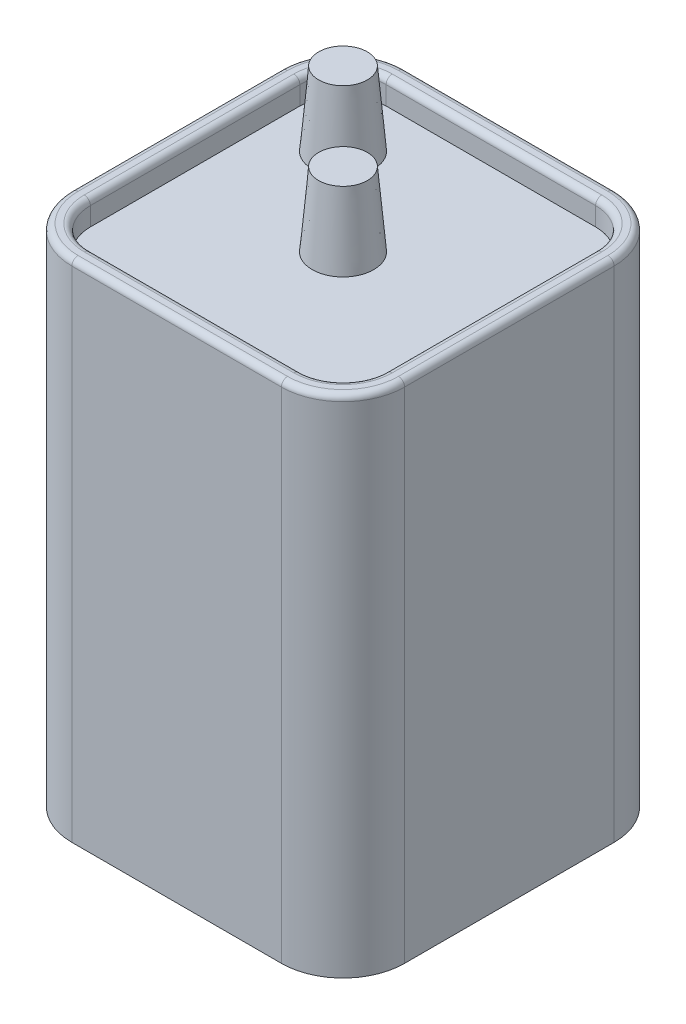
ISO-10303-21;
HEADER;
FILE_DESCRIPTION(('STEP AP214'),'2;1');
FILE_NAME('part.step','',(''),(''),'','','');
FILE_SCHEMA(('AUTOMOTIVE_DESIGN { 1 0 10303 214 1 1 1 1 }'));
ENDSEC;
DATA;
#1=APPLICATION_CONTEXT('core data for automotive mechanical design processes');
#2=APPLICATION_PROTOCOL_DEFINITION('international standard','automotive_design',2000,#1);
#3=PRODUCT_CONTEXT('',#1,'mechanical');
#4=PRODUCT('Part','Part','',(#3));
#5=PRODUCT_RELATED_PRODUCT_CATEGORY('part','',(#4));
#6=PRODUCT_DEFINITION_FORMATION('','',#4);
#7=PRODUCT_DEFINITION_CONTEXT('part definition',#1,'design');
#8=PRODUCT_DEFINITION('design','',#6,#7);
#9=PRODUCT_DEFINITION_SHAPE('','',#8);
#10=(LENGTH_UNIT() NAMED_UNIT(*) SI_UNIT(.MILLI.,.METRE.));
#11=(NAMED_UNIT(*) PLANE_ANGLE_UNIT() SI_UNIT($,.RADIAN.));
#12=(NAMED_UNIT(*) SI_UNIT($,.STERADIAN.) SOLID_ANGLE_UNIT());
#13=UNCERTAINTY_MEASURE_WITH_UNIT(LENGTH_MEASURE(1.E-05),#10,'distance_accuracy_value','');
#14=(GEOMETRIC_REPRESENTATION_CONTEXT(3) GLOBAL_UNCERTAINTY_ASSIGNED_CONTEXT((#13)) GLOBAL_UNIT_ASSIGNED_CONTEXT((#10,
#11,#12)) REPRESENTATION_CONTEXT('',''));
#15=CARTESIAN_POINT('',(0.,0.,0.));
#16=DIRECTION('',(0.,0.,1.));
#17=DIRECTION('',(1.,0.,0.));
#18=AXIS2_PLACEMENT_3D('',#15,#16,#17);
#19=CARTESIAN_POINT('',(34.29,104.14,-34.29));
#20=DIRECTION('',(-1.,0.,0.));
#21=DIRECTION('',(0.,0.,1.));
#22=AXIS2_PLACEMENT_3D('',#19,#20,#21);
#23=PLANE('',#22);
#24=DIRECTION('',(0.,-1.,0.));
#25=VECTOR('',#24,1.);
#26=CARTESIAN_POINT('',(34.29,104.14,-21.59));
#27=LINE('',#26,#25);
#28=CARTESIAN_POINT('',(34.29,0.,-21.59));
#29=VERTEX_POINT('',#28);
#30=CARTESIAN_POINT('',(34.29,102.87,-21.59));
#31=VERTEX_POINT('',#30);
#32=EDGE_CURVE('E303',#29,#31,#27,.F.);
#33=ORIENTED_EDGE('',*,*,#32,.T.);
#34=DIRECTION('',(0.,0.,-1.));
#35=VECTOR('',#34,1.);
#36=CARTESIAN_POINT('',(34.29,102.87,21.59));
#37=LINE('',#36,#35);
#38=CARTESIAN_POINT('',(34.29,102.87,21.59));
#39=VERTEX_POINT('',#38);
#40=EDGE_CURVE('E347',#31,#39,#37,.F.);
#41=ORIENTED_EDGE('',*,*,#40,.T.);
#42=DIRECTION('',(0.,-1.,0.));
#43=VECTOR('',#42,1.);
#44=CARTESIAN_POINT('',(34.29,104.14,21.59));
#45=LINE('',#44,#43);
#46=CARTESIAN_POINT('',(34.29,0.,21.59));
#47=VERTEX_POINT('',#46);
#48=EDGE_CURVE('E301',#39,#47,#45,.T.);
#49=ORIENTED_EDGE('',*,*,#48,.T.);
#50=DIRECTION('',(0.,0.,-1.));
#51=VECTOR('',#50,1.);
#52=CARTESIAN_POINT('',(34.29,0.,-34.29));
#53=LINE('',#52,#51);
#54=EDGE_CURVE('E252',#47,#29,#53,.T.);
#55=ORIENTED_EDGE('',*,*,#54,.T.);
#56=EDGE_LOOP('',(#33,#41,#49,#55));
#57=FACE_BOUND('',#56,.T.);
#58=ADVANCED_FACE('F41',(#57),#23,.F.);
#59=CARTESIAN_POINT('',(-34.29,104.14,-34.29));
#60=DIRECTION('',(0.,0.,1.));
#61=DIRECTION('',(1.,0.,0.));
#62=AXIS2_PLACEMENT_3D('',#59,#60,#61);
#63=PLANE('',#62);
#64=DIRECTION('',(0.,-1.,0.));
#65=VECTOR('',#64,1.);
#66=CARTESIAN_POINT('',(-21.59,104.14,-34.29));
#67=LINE('',#66,#65);
#68=CARTESIAN_POINT('',(-21.59,0.,-34.29));
#69=VERTEX_POINT('',#68);
#70=CARTESIAN_POINT('',(-21.59,102.87,-34.29));
#71=VERTEX_POINT('',#70);
#72=EDGE_CURVE('E298',#69,#71,#67,.F.);
#73=ORIENTED_EDGE('',*,*,#72,.T.);
#74=DIRECTION('',(-1.,0.,0.));
#75=VECTOR('',#74,1.);
#76=CARTESIAN_POINT('',(21.59,102.87,-34.29));
#77=LINE('',#76,#75);
#78=CARTESIAN_POINT('',(21.59,102.87,-34.29));
#79=VERTEX_POINT('',#78);
#80=EDGE_CURVE('E343',#71,#79,#77,.F.);
#81=ORIENTED_EDGE('',*,*,#80,.T.);
#82=DIRECTION('',(0.,-1.,0.));
#83=VECTOR('',#82,1.);
#84=CARTESIAN_POINT('',(21.59,104.14,-34.29));
#85=LINE('',#84,#83);
#86=CARTESIAN_POINT('',(21.59,0.,-34.29));
#87=VERTEX_POINT('',#86);
#88=EDGE_CURVE('E296',#79,#87,#85,.T.);
#89=ORIENTED_EDGE('',*,*,#88,.T.);
#90=DIRECTION('',(-1.,0.,0.));
#91=VECTOR('',#90,1.);
#92=CARTESIAN_POINT('',(-34.29,0.,-34.29));
#93=LINE('',#92,#91);
#94=EDGE_CURVE('E269',#87,#69,#93,.T.);
#95=ORIENTED_EDGE('',*,*,#94,.T.);
#96=EDGE_LOOP('',(#73,#81,#89,#95));
#97=FACE_BOUND('',#96,.T.);
#98=ADVANCED_FACE('F458',(#97),#63,.F.);
#99=CARTESIAN_POINT('',(-34.29,104.14,-34.29));
#100=DIRECTION('',(1.,0.,0.));
#101=DIRECTION('',(0.,0.,-1.));
#102=AXIS2_PLACEMENT_3D('',#99,#100,#101);
#103=PLANE('',#102);
#104=DIRECTION('',(0.,-1.,0.));
#105=VECTOR('',#104,1.);
#106=CARTESIAN_POINT('',(-34.29,104.14,21.59));
#107=LINE('',#106,#105);
#108=CARTESIAN_POINT('',(-34.29,0.,21.59));
#109=VERTEX_POINT('',#108);
#110=CARTESIAN_POINT('',(-34.29,102.87,21.59));
#111=VERTEX_POINT('',#110);
#112=EDGE_CURVE('E293',#109,#111,#107,.F.);
#113=ORIENTED_EDGE('',*,*,#112,.T.);
#114=DIRECTION('',(0.,0.,1.));
#115=VECTOR('',#114,1.);
#116=CARTESIAN_POINT('',(-34.29,102.87,-21.59));
#117=LINE('',#116,#115);
#118=CARTESIAN_POINT('',(-34.29,102.87,-21.59));
#119=VERTEX_POINT('',#118);
#120=EDGE_CURVE('E355',#111,#119,#117,.F.);
#121=ORIENTED_EDGE('',*,*,#120,.T.);
#122=DIRECTION('',(0.,-1.,0.));
#123=VECTOR('',#122,1.);
#124=CARTESIAN_POINT('',(-34.29,104.14,-21.59));
#125=LINE('',#124,#123);
#126=CARTESIAN_POINT('',(-34.29,0.,-21.59));
#127=VERTEX_POINT('',#126);
#128=EDGE_CURVE('E291',#119,#127,#125,.T.);
#129=ORIENTED_EDGE('',*,*,#128,.T.);
#130=DIRECTION('',(0.,0.,1.));
#131=VECTOR('',#130,1.);
#132=CARTESIAN_POINT('',(-34.29,0.,-34.29));
#133=LINE('',#132,#131);
#134=EDGE_CURVE('E272',#127,#109,#133,.T.);
#135=ORIENTED_EDGE('',*,*,#134,.T.);
#136=EDGE_LOOP('',(#113,#121,#129,#135));
#137=FACE_BOUND('',#136,.T.);
#138=ADVANCED_FACE('F465',(#137),#103,.F.);
#139=CARTESIAN_POINT('',(-34.29,104.14,34.29));
#140=DIRECTION('',(0.,0.,-1.));
#141=DIRECTION('',(-1.,0.,0.));
#142=AXIS2_PLACEMENT_3D('',#139,#140,#141);
#143=PLANE('',#142);
#144=DIRECTION('',(0.,-1.,0.));
#145=VECTOR('',#144,1.);
#146=CARTESIAN_POINT('',(21.59,104.14,34.29));
#147=LINE('',#146,#145);
#148=CARTESIAN_POINT('',(21.59,0.,34.29));
#149=VERTEX_POINT('',#148);
#150=CARTESIAN_POINT('',(21.59,102.87,34.29));
#151=VERTEX_POINT('',#150);
#152=EDGE_CURVE('E278',#149,#151,#147,.F.);
#153=ORIENTED_EDGE('',*,*,#152,.T.);
#154=DIRECTION('',(1.,0.,0.));
#155=VECTOR('',#154,1.);
#156=CARTESIAN_POINT('',(-21.59,102.87,34.29));
#157=LINE('',#156,#155);
#158=CARTESIAN_POINT('',(-21.59,102.87,34.29));
#159=VERTEX_POINT('',#158);
#160=EDGE_CURVE('E351',#151,#159,#157,.F.);
#161=ORIENTED_EDGE('',*,*,#160,.T.);
#162=DIRECTION('',(0.,-1.,0.));
#163=VECTOR('',#162,1.);
#164=CARTESIAN_POINT('',(-21.59,104.14,34.29));
#165=LINE('',#164,#163);
#166=CARTESIAN_POINT('',(-21.59,0.,34.29));
#167=VERTEX_POINT('',#166);
#168=EDGE_CURVE('E281',#159,#167,#165,.T.);
#169=ORIENTED_EDGE('',*,*,#168,.T.);
#170=DIRECTION('',(1.,0.,0.));
#171=VECTOR('',#170,1.);
#172=CARTESIAN_POINT('',(-34.29,0.,34.29));
#173=LINE('',#172,#171);
#174=EDGE_CURVE('E275',#167,#149,#173,.T.);
#175=ORIENTED_EDGE('',*,*,#174,.T.);
#176=EDGE_LOOP('',(#153,#161,#169,#175));
#177=FACE_BOUND('',#176,.T.);
#178=ADVANCED_FACE('F676',(#177),#143,.F.);
#179=CARTESIAN_POINT('',(0.,104.14,0.));
#180=DIRECTION('',(0.,1.,0.));
#181=DIRECTION('',(0.,0.,1.));
#182=AXIS2_PLACEMENT_3D('',#179,#180,#181);
#183=PLANE('',#182);
#184=DIRECTION('',(-1.,0.,0.));
#185=VECTOR('',#184,1.);
#186=CARTESIAN_POINT('',(-21.59,104.14,-33.02));
#187=LINE('',#186,#185);
#188=CARTESIAN_POINT('',(21.59,104.14,-33.02));
#189=VERTEX_POINT('',#188);
#190=CARTESIAN_POINT('',(-21.59,104.14,-33.02));
#191=VERTEX_POINT('',#190);
#192=EDGE_CURVE('E335',#189,#191,#187,.T.);
#193=ORIENTED_EDGE('',*,*,#192,.T.);
#194=CARTESIAN_POINT('',(-21.59,104.14,-21.59));
#195=DIRECTION('',(0.,1.,0.));
#196=DIRECTION('',(0.,0.,1.));
#197=AXIS2_PLACEMENT_3D('',#194,#195,#196);
#198=CIRCLE('',#197,11.43);
#199=CARTESIAN_POINT('',(-33.02,104.14,-21.59));
#200=VERTEX_POINT('',#199);
#201=EDGE_CURVE('E337',#191,#200,#198,.T.);
#202=ORIENTED_EDGE('',*,*,#201,.T.);
#203=DIRECTION('',(0.,0.,1.));
#204=VECTOR('',#203,1.);
#205=CARTESIAN_POINT('',(-33.02,104.14,21.59));
#206=LINE('',#205,#204);
#207=CARTESIAN_POINT('',(-33.02,104.14,21.59));
#208=VERTEX_POINT('',#207);
#209=EDGE_CURVE('E323',#200,#208,#206,.T.);
#210=ORIENTED_EDGE('',*,*,#209,.T.);
#211=CARTESIAN_POINT('',(-21.59,104.14,21.59));
#212=DIRECTION('',(0.,1.,0.));
#213=DIRECTION('',(0.,0.,1.));
#214=AXIS2_PLACEMENT_3D('',#211,#212,#213);
#215=CIRCLE('',#214,11.43);
#216=CARTESIAN_POINT('',(-21.59,104.14,33.02));
#217=VERTEX_POINT('',#216);
#218=EDGE_CURVE('E325',#208,#217,#215,.T.);
#219=ORIENTED_EDGE('',*,*,#218,.T.);
#220=DIRECTION('',(1.,0.,0.));
#221=VECTOR('',#220,1.);
#222=CARTESIAN_POINT('',(21.59,104.14,33.02));
#223=LINE('',#222,#221);
#224=CARTESIAN_POINT('',(21.59,104.14,33.02));
#225=VERTEX_POINT('',#224);
#226=EDGE_CURVE('E327',#217,#225,#223,.T.);
#227=ORIENTED_EDGE('',*,*,#226,.T.);
#228=CARTESIAN_POINT('',(21.59,104.14,21.59));
#229=DIRECTION('',(0.,1.,0.));
#230=DIRECTION('',(0.,0.,1.));
#231=AXIS2_PLACEMENT_3D('',#228,#229,#230);
#232=CIRCLE('',#231,11.43);
#233=CARTESIAN_POINT('',(33.02,104.14,21.59));
#234=VERTEX_POINT('',#233);
#235=EDGE_CURVE('E329',#225,#234,#232,.T.);
#236=ORIENTED_EDGE('',*,*,#235,.T.);
#237=DIRECTION('',(0.,0.,-1.));
#238=VECTOR('',#237,1.);
#239=CARTESIAN_POINT('',(33.02,104.14,-21.59));
#240=LINE('',#239,#238);
#241=CARTESIAN_POINT('',(33.02,104.14,-21.59));
#242=VERTEX_POINT('',#241);
#243=EDGE_CURVE('E331',#234,#242,#240,.T.);
#244=ORIENTED_EDGE('',*,*,#243,.T.);
#245=CARTESIAN_POINT('',(21.59,104.14,-21.59));
#246=DIRECTION('',(0.,1.,0.));
#247=DIRECTION('',(0.,0.,1.));
#248=AXIS2_PLACEMENT_3D('',#245,#246,#247);
#249=CIRCLE('',#248,11.43);
#250=EDGE_CURVE('E333',#242,#189,#249,.T.);
#251=ORIENTED_EDGE('',*,*,#250,.T.);
#252=EDGE_LOOP('',(#193,#202,#210,#219,#227,#236,#244,#251));
#253=FACE_BOUND('',#252,.T.);
#254=CARTESIAN_POINT('',(-21.59,104.14,21.59));
#255=DIRECTION('',(0.,1.,0.));
#256=DIRECTION('',(0.,0.,1.));
#257=AXIS2_PLACEMENT_3D('',#254,#255,#256);
#258=CIRCLE('',#257,10.16);
#259=CARTESIAN_POINT('',(-21.59,104.14,31.75));
#260=VERTEX_POINT('',#259);
#261=CARTESIAN_POINT('',(-31.75,104.14,21.59));
#262=VERTEX_POINT('',#261);
#263=EDGE_CURVE('E318',#260,#262,#258,.F.);
#264=ORIENTED_EDGE('',*,*,#263,.T.);
#265=DIRECTION('',(0.,0.,1.));
#266=VECTOR('',#265,1.);
#267=CARTESIAN_POINT('',(-31.75,104.14,-21.59));
#268=LINE('',#267,#266);
#269=CARTESIAN_POINT('',(-31.75,104.14,-21.59));
#270=VERTEX_POINT('',#269);
#271=EDGE_CURVE('E320',#262,#270,#268,.F.);
#272=ORIENTED_EDGE('',*,*,#271,.T.);
#273=CARTESIAN_POINT('',(-21.59,104.14,-21.59));
#274=DIRECTION('',(0.,1.,0.));
#275=DIRECTION('',(0.,0.,1.));
#276=AXIS2_PLACEMENT_3D('',#273,#274,#275);
#277=CIRCLE('',#276,10.16);
#278=CARTESIAN_POINT('',(-21.59,104.14,-31.75));
#279=VERTEX_POINT('',#278);
#280=EDGE_CURVE('E306',#270,#279,#277,.F.);
#281=ORIENTED_EDGE('',*,*,#280,.T.);
#282=DIRECTION('',(-1.,0.,0.));
#283=VECTOR('',#282,1.);
#284=CARTESIAN_POINT('',(21.59,104.14,-31.75));
#285=LINE('',#284,#283);
#286=CARTESIAN_POINT('',(21.59,104.14,-31.75));
#287=VERTEX_POINT('',#286);
#288=EDGE_CURVE('E308',#279,#287,#285,.F.);
#289=ORIENTED_EDGE('',*,*,#288,.T.);
#290=CARTESIAN_POINT('',(21.59,104.14,-21.59));
#291=DIRECTION('',(0.,1.,0.));
#292=DIRECTION('',(0.,0.,1.));
#293=AXIS2_PLACEMENT_3D('',#290,#291,#292);
#294=CIRCLE('',#293,10.16);
#295=CARTESIAN_POINT('',(31.75,104.14,-21.59));
#296=VERTEX_POINT('',#295);
#297=EDGE_CURVE('E310',#287,#296,#294,.F.);
#298=ORIENTED_EDGE('',*,*,#297,.T.);
#299=DIRECTION('',(0.,0.,-1.));
#300=VECTOR('',#299,1.);
#301=CARTESIAN_POINT('',(31.75,104.14,21.59));
#302=LINE('',#301,#300);
#303=CARTESIAN_POINT('',(31.75,104.14,21.59));
#304=VERTEX_POINT('',#303);
#305=EDGE_CURVE('E312',#296,#304,#302,.F.);
#306=ORIENTED_EDGE('',*,*,#305,.T.);
#307=CARTESIAN_POINT('',(21.59,104.14,21.59));
#308=DIRECTION('',(0.,1.,0.));
#309=DIRECTION('',(0.,0.,1.));
#310=AXIS2_PLACEMENT_3D('',#307,#308,#309);
#311=CIRCLE('',#310,10.16);
#312=CARTESIAN_POINT('',(21.59,104.14,31.75));
#313=VERTEX_POINT('',#312);
#314=EDGE_CURVE('E314',#304,#313,#311,.F.);
#315=ORIENTED_EDGE('',*,*,#314,.T.);
#316=DIRECTION('',(1.,0.,0.));
#317=VECTOR('',#316,1.);
#318=CARTESIAN_POINT('',(-21.59,104.14,31.75));
#319=LINE('',#318,#317);
#320=EDGE_CURVE('E316',#313,#260,#319,.F.);
#321=ORIENTED_EDGE('',*,*,#320,.T.);
#322=EDGE_LOOP('',(#264,#272,#281,#289,#298,#306,#315,#321));
#323=FACE_BOUND('',#322,.T.);
#324=ADVANCED_FACE('F419',(#253,#323),#183,.T.);
#325=CARTESIAN_POINT('',(0.,0.,0.));
#326=DIRECTION('',(0.,1.,0.));
#327=DIRECTION('',(0.,0.,1.));
#328=AXIS2_PLACEMENT_3D('',#325,#326,#327);
#329=PLANE('',#328);
#330=ORIENTED_EDGE('',*,*,#174,.F.);
#331=CARTESIAN_POINT('',(-21.59,0.,21.59));
#332=DIRECTION('',(0.,1.,0.));
#333=DIRECTION('',(0.,0.,1.));
#334=AXIS2_PLACEMENT_3D('',#331,#332,#333);
#335=CIRCLE('',#334,12.7);
#336=EDGE_CURVE('E289',#167,#109,#335,.F.);
#337=ORIENTED_EDGE('',*,*,#336,.T.);
#338=ORIENTED_EDGE('',*,*,#134,.F.);
#339=CARTESIAN_POINT('',(-21.59,0.,-21.59));
#340=DIRECTION('',(0.,1.,0.));
#341=DIRECTION('',(0.,0.,1.));
#342=AXIS2_PLACEMENT_3D('',#339,#340,#341);
#343=CIRCLE('',#342,12.7);
#344=EDGE_CURVE('E287',#127,#69,#343,.F.);
#345=ORIENTED_EDGE('',*,*,#344,.T.);
#346=ORIENTED_EDGE('',*,*,#94,.F.);
#347=CARTESIAN_POINT('',(21.59,0.,-21.59));
#348=DIRECTION('',(0.,1.,0.));
#349=DIRECTION('',(0.,0.,1.));
#350=AXIS2_PLACEMENT_3D('',#347,#348,#349);
#351=CIRCLE('',#350,12.7);
#352=EDGE_CURVE('E285',#87,#29,#351,.F.);
#353=ORIENTED_EDGE('',*,*,#352,.T.);
#354=ORIENTED_EDGE('',*,*,#54,.F.);
#355=CARTESIAN_POINT('',(21.59,0.,21.59));
#356=DIRECTION('',(0.,1.,0.));
#357=DIRECTION('',(0.,0.,1.));
#358=AXIS2_PLACEMENT_3D('',#355,#356,#357);
#359=CIRCLE('',#358,12.7);
#360=EDGE_CURVE('E283',#47,#149,#359,.F.);
#361=ORIENTED_EDGE('',*,*,#360,.T.);
#362=EDGE_LOOP('',(#330,#337,#338,#345,#346,#353,#354,#361));
#363=FACE_BOUND('',#362,.T.);
#364=ADVANCED_FACE('F474',(#363),#329,.F.);
#365=CARTESIAN_POINT('',(-21.59,104.14,21.59));
#366=DIRECTION('',(0.,-1.,0.));
#367=DIRECTION('',(0.,0.,-1.));
#368=AXIS2_PLACEMENT_3D('',#365,#366,#367);
#369=CYLINDRICAL_SURFACE('',#368,12.7);
#370=ORIENTED_EDGE('',*,*,#168,.F.);
#371=CARTESIAN_POINT('',(-21.59,102.87,21.59));
#372=DIRECTION('',(0.,1.,0.));
#373=DIRECTION('',(0.,0.,1.));
#374=AXIS2_PLACEMENT_3D('',#371,#372,#373);
#375=CIRCLE('',#374,12.7);
#376=EDGE_CURVE('E353',#159,#111,#375,.F.);
#377=ORIENTED_EDGE('',*,*,#376,.T.);
#378=ORIENTED_EDGE('',*,*,#112,.F.);
#379=ORIENTED_EDGE('',*,*,#336,.F.);
#380=EDGE_LOOP('',(#370,#377,#378,#379));
#381=FACE_BOUND('',#380,.T.);
#382=ADVANCED_FACE('F470',(#381),#369,.T.);
#383=CARTESIAN_POINT('',(-21.59,104.14,-21.59));
#384=DIRECTION('',(0.,-1.,0.));
#385=DIRECTION('',(0.,0.,-1.));
#386=AXIS2_PLACEMENT_3D('',#383,#384,#385);
#387=CYLINDRICAL_SURFACE('',#386,12.7);
#388=ORIENTED_EDGE('',*,*,#128,.F.);
#389=CARTESIAN_POINT('',(-21.59,102.87,-21.59));
#390=DIRECTION('',(0.,1.,0.));
#391=DIRECTION('',(0.,0.,1.));
#392=AXIS2_PLACEMENT_3D('',#389,#390,#391);
#393=CIRCLE('',#392,12.7);
#394=EDGE_CURVE('E340',#119,#71,#393,.F.);
#395=ORIENTED_EDGE('',*,*,#394,.T.);
#396=ORIENTED_EDGE('',*,*,#72,.F.);
#397=ORIENTED_EDGE('',*,*,#344,.F.);
#398=EDGE_LOOP('',(#388,#395,#396,#397));
#399=FACE_BOUND('',#398,.T.);
#400=ADVANCED_FACE('F473',(#399),#387,.T.);
#401=CARTESIAN_POINT('',(21.59,104.14,-21.59));
#402=DIRECTION('',(0.,-1.,0.));
#403=DIRECTION('',(0.,0.,-1.));
#404=AXIS2_PLACEMENT_3D('',#401,#402,#403);
#405=CYLINDRICAL_SURFACE('',#404,12.7);
#406=ORIENTED_EDGE('',*,*,#88,.F.);
#407=CARTESIAN_POINT('',(21.59,102.87,-21.59));
#408=DIRECTION('',(0.,1.,0.));
#409=DIRECTION('',(0.,0.,1.));
#410=AXIS2_PLACEMENT_3D('',#407,#408,#409);
#411=CIRCLE('',#410,12.7);
#412=EDGE_CURVE('E345',#79,#31,#411,.F.);
#413=ORIENTED_EDGE('',*,*,#412,.T.);
#414=ORIENTED_EDGE('',*,*,#32,.F.);
#415=ORIENTED_EDGE('',*,*,#352,.F.);
#416=EDGE_LOOP('',(#406,#413,#414,#415));
#417=FACE_BOUND('',#416,.T.);
#418=ADVANCED_FACE('F478',(#417),#405,.T.);
#419=CARTESIAN_POINT('',(21.59,104.14,21.59));
#420=DIRECTION('',(0.,-1.,0.));
#421=DIRECTION('',(0.,0.,-1.));
#422=AXIS2_PLACEMENT_3D('',#419,#420,#421);
#423=CYLINDRICAL_SURFACE('',#422,12.7);
#424=ORIENTED_EDGE('',*,*,#48,.F.);
#425=CARTESIAN_POINT('',(21.59,102.87,21.59));
#426=DIRECTION('',(0.,1.,0.));
#427=DIRECTION('',(0.,0.,1.));
#428=AXIS2_PLACEMENT_3D('',#425,#426,#427);
#429=CIRCLE('',#428,12.7);
#430=EDGE_CURVE('E349',#39,#151,#429,.F.);
#431=ORIENTED_EDGE('',*,*,#430,.T.);
#432=ORIENTED_EDGE('',*,*,#152,.F.);
#433=ORIENTED_EDGE('',*,*,#360,.F.);
#434=EDGE_LOOP('',(#424,#431,#432,#433));
#435=FACE_BOUND('',#434,.T.);
#436=ADVANCED_FACE('F482',(#435),#423,.T.);
#437=CARTESIAN_POINT('',(-21.59,99.06,-21.59));
#438=DIRECTION('',(0.,1.,0.));
#439=DIRECTION('',(0.,0.,1.));
#440=AXIS2_PLACEMENT_3D('',#437,#438,#439);
#441=CYLINDRICAL_SURFACE('',#440,8.89);
#442=DIRECTION('',(0.,1.,0.));
#443=VECTOR('',#442,1.);
#444=CARTESIAN_POINT('',(-21.59,99.06,-30.48));
#445=LINE('',#444,#443);
#446=CARTESIAN_POINT('',(-21.59,99.06,-30.48));
#447=VERTEX_POINT('',#446);
#448=CARTESIAN_POINT('',(-21.59,102.87,-30.48));
#449=VERTEX_POINT('',#448);
#450=EDGE_CURVE('E250',#447,#449,#445,.T.);
#451=ORIENTED_EDGE('',*,*,#450,.T.);
#452=CARTESIAN_POINT('',(-21.59,102.87,-21.59));
#453=DIRECTION('',(0.,1.,0.));
#454=DIRECTION('',(0.,0.,1.));
#455=AXIS2_PLACEMENT_3D('',#452,#453,#454);
#456=CIRCLE('',#455,8.89);
#457=CARTESIAN_POINT('',(-30.48,102.87,-21.59));
#458=VERTEX_POINT('',#457);
#459=EDGE_CURVE('E11',#449,#458,#456,.T.);
#460=ORIENTED_EDGE('',*,*,#459,.T.);
#461=DIRECTION('',(0.,1.,0.));
#462=VECTOR('',#461,1.);
#463=CARTESIAN_POINT('',(-30.48,99.06,-21.59));
#464=LINE('',#463,#462);
#465=CARTESIAN_POINT('',(-30.48,99.06,-21.59));
#466=VERTEX_POINT('',#465);
#467=EDGE_CURVE('E203',#466,#458,#464,.T.);
#468=ORIENTED_EDGE('',*,*,#467,.F.);
#469=CARTESIAN_POINT('',(-21.59,99.06,-21.59));
#470=DIRECTION('',(0.,1.,0.));
#471=DIRECTION('',(0.,0.,1.));
#472=AXIS2_PLACEMENT_3D('',#469,#470,#471);
#473=CIRCLE('',#472,8.89);
#474=EDGE_CURVE('E207',#447,#466,#473,.T.);
#475=ORIENTED_EDGE('',*,*,#474,.F.);
#476=EDGE_LOOP('',(#451,#460,#468,#475));
#477=FACE_BOUND('',#476,.T.);
#478=ADVANCED_FACE('F205',(#477),#441,.F.);
#479=CARTESIAN_POINT('',(21.59,99.06,-30.48));
#480=DIRECTION('',(0.,0.,-1.));
#481=DIRECTION('',(-1.,0.,0.));
#482=AXIS2_PLACEMENT_3D('',#479,#480,#481);
#483=PLANE('',#482);
#484=DIRECTION('',(0.,1.,0.));
#485=VECTOR('',#484,1.);
#486=CARTESIAN_POINT('',(21.59,99.06,-30.48));
#487=LINE('',#486,#485);
#488=CARTESIAN_POINT('',(21.59,99.06,-30.48));
#489=VERTEX_POINT('',#488);
#490=CARTESIAN_POINT('',(21.59,102.87,-30.48));
#491=VERTEX_POINT('',#490);
#492=EDGE_CURVE('E253',#489,#491,#487,.T.);
#493=ORIENTED_EDGE('',*,*,#492,.T.);
#494=DIRECTION('',(-1.,0.,0.));
#495=VECTOR('',#494,1.);
#496=CARTESIAN_POINT('',(-21.59,102.87,-30.48));
#497=LINE('',#496,#495);
#498=EDGE_CURVE('E50',#491,#449,#497,.T.);
#499=ORIENTED_EDGE('',*,*,#498,.T.);
#500=ORIENTED_EDGE('',*,*,#450,.F.);
#501=DIRECTION('',(-1.,0.,0.));
#502=VECTOR('',#501,1.);
#503=CARTESIAN_POINT('',(21.59,99.06,-30.48));
#504=LINE('',#503,#502);
#505=EDGE_CURVE('E214',#489,#447,#504,.T.);
#506=ORIENTED_EDGE('',*,*,#505,.F.);
#507=EDGE_LOOP('',(#493,#499,#500,#506));
#508=FACE_BOUND('',#507,.T.);
#509=ADVANCED_FACE('F447',(#508),#483,.F.);
#510=CARTESIAN_POINT('',(21.59,99.06,-21.59));
#511=DIRECTION('',(0.,1.,0.));
#512=DIRECTION('',(0.,0.,1.));
#513=AXIS2_PLACEMENT_3D('',#510,#511,#512);
#514=CYLINDRICAL_SURFACE('',#513,8.89);
#515=DIRECTION('',(0.,1.,0.));
#516=VECTOR('',#515,1.);
#517=CARTESIAN_POINT('',(30.48,99.06,-21.59));
#518=LINE('',#517,#516);
#519=CARTESIAN_POINT('',(30.48,99.06,-21.59));
#520=VERTEX_POINT('',#519);
#521=CARTESIAN_POINT('',(30.48,102.87,-21.59));
#522=VERTEX_POINT('',#521);
#523=EDGE_CURVE('E255',#520,#522,#518,.T.);
#524=ORIENTED_EDGE('',*,*,#523,.T.);
#525=CARTESIAN_POINT('',(21.59,102.87,-21.59));
#526=DIRECTION('',(0.,1.,0.));
#527=DIRECTION('',(0.,0.,1.));
#528=AXIS2_PLACEMENT_3D('',#525,#526,#527);
#529=CIRCLE('',#528,8.89);
#530=EDGE_CURVE('E65',#522,#491,#529,.T.);
#531=ORIENTED_EDGE('',*,*,#530,.T.);
#532=ORIENTED_EDGE('',*,*,#492,.F.);
#533=CARTESIAN_POINT('',(21.59,99.06,-21.59));
#534=DIRECTION('',(0.,1.,0.));
#535=DIRECTION('',(0.,0.,1.));
#536=AXIS2_PLACEMENT_3D('',#533,#534,#535);
#537=CIRCLE('',#536,8.89);
#538=EDGE_CURVE('E247',#520,#489,#537,.T.);
#539=ORIENTED_EDGE('',*,*,#538,.F.);
#540=EDGE_LOOP('',(#524,#531,#532,#539));
#541=FACE_BOUND('',#540,.T.);
#542=ADVANCED_FACE('F448',(#541),#514,.F.);
#543=CARTESIAN_POINT('',(30.48,99.06,21.59));
#544=DIRECTION('',(1.,0.,0.));
#545=DIRECTION('',(0.,0.,-1.));
#546=AXIS2_PLACEMENT_3D('',#543,#544,#545);
#547=PLANE('',#546);
#548=DIRECTION('',(0.,1.,0.));
#549=VECTOR('',#548,1.);
#550=CARTESIAN_POINT('',(30.48,99.06,21.59));
#551=LINE('',#550,#549);
#552=CARTESIAN_POINT('',(30.48,99.06,21.59));
#553=VERTEX_POINT('',#552);
#554=CARTESIAN_POINT('',(30.48,102.87,21.59));
#555=VERTEX_POINT('',#554);
#556=EDGE_CURVE('E257',#553,#555,#551,.T.);
#557=ORIENTED_EDGE('',*,*,#556,.T.);
#558=DIRECTION('',(0.,0.,-1.));
#559=VECTOR('',#558,1.);
#560=CARTESIAN_POINT('',(30.48,102.87,-21.59));
#561=LINE('',#560,#559);
#562=EDGE_CURVE('E365',#555,#522,#561,.T.);
#563=ORIENTED_EDGE('',*,*,#562,.T.);
#564=ORIENTED_EDGE('',*,*,#523,.F.);
#565=DIRECTION('',(0.,0.,-1.));
#566=VECTOR('',#565,1.);
#567=CARTESIAN_POINT('',(30.48,99.06,21.59));
#568=LINE('',#567,#566);
#569=EDGE_CURVE('E244',#553,#520,#568,.T.);
#570=ORIENTED_EDGE('',*,*,#569,.F.);
#571=EDGE_LOOP('',(#557,#563,#564,#570));
#572=FACE_BOUND('',#571,.T.);
#573=ADVANCED_FACE('F445',(#572),#547,.F.);
#574=CARTESIAN_POINT('',(21.59,99.06,21.59));
#575=DIRECTION('',(0.,1.,0.));
#576=DIRECTION('',(0.,0.,1.));
#577=AXIS2_PLACEMENT_3D('',#574,#575,#576);
#578=CYLINDRICAL_SURFACE('',#577,8.89);
#579=DIRECTION('',(0.,1.,0.));
#580=VECTOR('',#579,1.);
#581=CARTESIAN_POINT('',(21.59,99.06,30.48));
#582=LINE('',#581,#580);
#583=CARTESIAN_POINT('',(21.59,99.06,30.48));
#584=VERTEX_POINT('',#583);
#585=CARTESIAN_POINT('',(21.59,102.87,30.48));
#586=VERTEX_POINT('',#585);
#587=EDGE_CURVE('E260',#584,#586,#582,.T.);
#588=ORIENTED_EDGE('',*,*,#587,.T.);
#589=CARTESIAN_POINT('',(21.59,102.87,21.59));
#590=DIRECTION('',(0.,1.,0.));
#591=DIRECTION('',(0.,0.,1.));
#592=AXIS2_PLACEMENT_3D('',#589,#590,#591);
#593=CIRCLE('',#592,8.89);
#594=EDGE_CURVE('E363',#586,#555,#593,.T.);
#595=ORIENTED_EDGE('',*,*,#594,.T.);
#596=ORIENTED_EDGE('',*,*,#556,.F.);
#597=CARTESIAN_POINT('',(21.59,99.06,21.59));
#598=DIRECTION('',(0.,1.,0.));
#599=DIRECTION('',(0.,0.,1.));
#600=AXIS2_PLACEMENT_3D('',#597,#598,#599);
#601=CIRCLE('',#600,8.89);
#602=EDGE_CURVE('E241',#584,#553,#601,.T.);
#603=ORIENTED_EDGE('',*,*,#602,.F.);
#604=EDGE_LOOP('',(#588,#595,#596,#603));
#605=FACE_BOUND('',#604,.T.);
#606=ADVANCED_FACE('F442',(#605),#578,.F.);
#607=CARTESIAN_POINT('',(-21.59,99.06,30.48));
#608=DIRECTION('',(0.,0.,1.));
#609=DIRECTION('',(1.,0.,0.));
#610=AXIS2_PLACEMENT_3D('',#607,#608,#609);
#611=PLANE('',#610);
#612=DIRECTION('',(0.,1.,0.));
#613=VECTOR('',#612,1.);
#614=CARTESIAN_POINT('',(-21.59,99.06,30.48));
#615=LINE('',#614,#613);
#616=CARTESIAN_POINT('',(-21.59,99.06,30.48));
#617=VERTEX_POINT('',#616);
#618=CARTESIAN_POINT('',(-21.59,102.87,30.48));
#619=VERTEX_POINT('',#618);
#620=EDGE_CURVE('E263',#617,#619,#615,.T.);
#621=ORIENTED_EDGE('',*,*,#620,.T.);
#622=DIRECTION('',(1.,0.,0.));
#623=VECTOR('',#622,1.);
#624=CARTESIAN_POINT('',(21.59,102.87,30.48));
#625=LINE('',#624,#623);
#626=EDGE_CURVE('E361',#619,#586,#625,.T.);
#627=ORIENTED_EDGE('',*,*,#626,.T.);
#628=ORIENTED_EDGE('',*,*,#587,.F.);
#629=DIRECTION('',(1.,0.,0.));
#630=VECTOR('',#629,1.);
#631=CARTESIAN_POINT('',(-21.59,99.06,30.48));
#632=LINE('',#631,#630);
#633=EDGE_CURVE('E238',#617,#584,#632,.T.);
#634=ORIENTED_EDGE('',*,*,#633,.F.);
#635=EDGE_LOOP('',(#621,#627,#628,#634));
#636=FACE_BOUND('',#635,.T.);
#637=ADVANCED_FACE('F439',(#636),#611,.F.);
#638=CARTESIAN_POINT('',(-21.59,99.06,21.59));
#639=DIRECTION('',(0.,1.,0.));
#640=DIRECTION('',(0.,0.,1.));
#641=AXIS2_PLACEMENT_3D('',#638,#639,#640);
#642=CYLINDRICAL_SURFACE('',#641,8.89);
#643=DIRECTION('',(0.,1.,0.));
#644=VECTOR('',#643,1.);
#645=CARTESIAN_POINT('',(-30.48,99.06,21.59));
#646=LINE('',#645,#644);
#647=CARTESIAN_POINT('',(-30.48,99.06,21.59));
#648=VERTEX_POINT('',#647);
#649=CARTESIAN_POINT('',(-30.48,102.87,21.59));
#650=VERTEX_POINT('',#649);
#651=EDGE_CURVE('E213',#648,#650,#646,.T.);
#652=ORIENTED_EDGE('',*,*,#651,.T.);
#653=CARTESIAN_POINT('',(-21.59,102.87,21.59));
#654=DIRECTION('',(0.,1.,0.));
#655=DIRECTION('',(0.,0.,1.));
#656=AXIS2_PLACEMENT_3D('',#653,#654,#655);
#657=CIRCLE('',#656,8.89);
#658=EDGE_CURVE('E359',#650,#619,#657,.T.);
#659=ORIENTED_EDGE('',*,*,#658,.T.);
#660=ORIENTED_EDGE('',*,*,#620,.F.);
#661=CARTESIAN_POINT('',(-21.59,99.06,21.59));
#662=DIRECTION('',(0.,1.,0.));
#663=DIRECTION('',(0.,0.,1.));
#664=AXIS2_PLACEMENT_3D('',#661,#662,#663);
#665=CIRCLE('',#664,8.89);
#666=EDGE_CURVE('E223',#648,#617,#665,.T.);
#667=ORIENTED_EDGE('',*,*,#666,.F.);
#668=EDGE_LOOP('',(#652,#659,#660,#667));
#669=FACE_BOUND('',#668,.T.);
#670=ADVANCED_FACE('F435',(#669),#642,.F.);
#671=CARTESIAN_POINT('',(-30.48,99.06,-21.59));
#672=DIRECTION('',(-1.,0.,0.));
#673=DIRECTION('',(0.,0.,1.));
#674=AXIS2_PLACEMENT_3D('',#671,#672,#673);
#675=PLANE('',#674);
#676=ORIENTED_EDGE('',*,*,#467,.T.);
#677=DIRECTION('',(0.,0.,1.));
#678=VECTOR('',#677,1.);
#679=CARTESIAN_POINT('',(-30.48,102.87,21.59));
#680=LINE('',#679,#678);
#681=EDGE_CURVE('E357',#458,#650,#680,.T.);
#682=ORIENTED_EDGE('',*,*,#681,.T.);
#683=ORIENTED_EDGE('',*,*,#651,.F.);
#684=DIRECTION('',(0.,0.,1.));
#685=VECTOR('',#684,1.);
#686=CARTESIAN_POINT('',(-30.48,99.06,-21.59));
#687=LINE('',#686,#685);
#688=EDGE_CURVE('E217',#466,#648,#687,.T.);
#689=ORIENTED_EDGE('',*,*,#688,.F.);
#690=EDGE_LOOP('',(#676,#682,#683,#689));
#691=FACE_BOUND('',#690,.T.);
#692=ADVANCED_FACE('F218',(#691),#675,.F.);
#693=CARTESIAN_POINT('',(-21.59,99.06,-21.59));
#694=DIRECTION('',(0.,1.,0.));
#695=DIRECTION('',(0.,0.,1.));
#696=AXIS2_PLACEMENT_3D('',#693,#694,#695);
#697=PLANE('',#696);
#698=CARTESIAN_POINT('',(0.,99.06,0.));
#699=DIRECTION('',(0.,1.,0.));
#700=DIRECTION('',(0.,0.,1.));
#701=AXIS2_PLACEMENT_3D('',#698,#699,#700);
#702=CIRCLE('',#701,6.35);
#703=CARTESIAN_POINT('',(0.,99.06,6.35));
#704=VERTEX_POINT('',#703);
#705=EDGE_CURVE('E849',#704,#704,#702,.T.);
#706=ORIENTED_EDGE('',*,*,#705,.F.);
#707=EDGE_LOOP('',(#706));
#708=FACE_BOUND('',#707,.T.);
#709=CARTESIAN_POINT('',(-17.9605122421382,99.06,-17.9605122421384));
#710=DIRECTION('',(0.,1.,0.));
#711=DIRECTION('',(0.,0.,1.));
#712=AXIS2_PLACEMENT_3D('',#709,#710,#711);
#713=CIRCLE('',#712,6.35);
#714=CARTESIAN_POINT('',(-17.9605122421382,99.06,-11.6105122421384));
#715=VERTEX_POINT('',#714);
#716=EDGE_CURVE('E234',#715,#715,#713,.T.);
#717=ORIENTED_EDGE('',*,*,#716,.F.);
#718=EDGE_LOOP('',(#717));
#719=FACE_BOUND('',#718,.T.);
#720=ORIENTED_EDGE('',*,*,#474,.T.);
#721=ORIENTED_EDGE('',*,*,#688,.T.);
#722=ORIENTED_EDGE('',*,*,#666,.T.);
#723=ORIENTED_EDGE('',*,*,#633,.T.);
#724=ORIENTED_EDGE('',*,*,#602,.T.);
#725=ORIENTED_EDGE('',*,*,#569,.T.);
#726=ORIENTED_EDGE('',*,*,#538,.T.);
#727=ORIENTED_EDGE('',*,*,#505,.T.);
#728=EDGE_LOOP('',(#720,#721,#722,#723,#724,#725,#726,#727));
#729=FACE_BOUND('',#728,.T.);
#730=ADVANCED_FACE('F225',(#708,#719,#729),#697,.T.);
#731=CARTESIAN_POINT('',(21.59,102.87,21.59));
#732=DIRECTION('',(0.,1.,0.));
#733=DIRECTION('',(0.,0.,1.));
#734=AXIS2_PLACEMENT_3D('',#731,#732,#733);
#735=TOROIDAL_SURFACE('',#734,11.43,1.27);
#736=CARTESIAN_POINT('',(21.59,102.87,33.02));
#737=DIRECTION('',(-1.,0.,0.));
#738=DIRECTION('',(0.,0.,1.));
#739=AXIS2_PLACEMENT_3D('',#736,#737,#738);
#740=CIRCLE('',#739,1.27);
#741=EDGE_CURVE('E231',#151,#225,#740,.T.);
#742=ORIENTED_EDGE('',*,*,#741,.F.);
#743=ORIENTED_EDGE('',*,*,#430,.F.);
#744=CARTESIAN_POINT('',(33.02,102.87,21.59));
#745=DIRECTION('',(0.,0.,-1.));
#746=DIRECTION('',(-1.,0.,0.));
#747=AXIS2_PLACEMENT_3D('',#744,#745,#746);
#748=CIRCLE('',#747,1.27);
#749=EDGE_CURVE('E228',#234,#39,#748,.T.);
#750=ORIENTED_EDGE('',*,*,#749,.F.);
#751=ORIENTED_EDGE('',*,*,#235,.F.);
#752=EDGE_LOOP('',(#742,#743,#750,#751));
#753=FACE_BOUND('',#752,.T.);
#754=ADVANCED_FACE('F514',(#753),#735,.T.);
#755=CARTESIAN_POINT('',(33.02,102.87,0.));
#756=DIRECTION('',(0.,0.,1.));
#757=DIRECTION('',(1.,0.,0.));
#758=AXIS2_PLACEMENT_3D('',#755,#756,#757);
#759=CYLINDRICAL_SURFACE('',#758,1.27);
#760=ORIENTED_EDGE('',*,*,#749,.T.);
#761=ORIENTED_EDGE('',*,*,#40,.F.);
#762=CARTESIAN_POINT('',(33.02,102.87,-21.59));
#763=DIRECTION('',(0.,0.,-1.));
#764=DIRECTION('',(-1.,0.,0.));
#765=AXIS2_PLACEMENT_3D('',#762,#763,#764);
#766=CIRCLE('',#765,1.27);
#767=EDGE_CURVE('E382',#242,#31,#766,.T.);
#768=ORIENTED_EDGE('',*,*,#767,.F.);
#769=ORIENTED_EDGE('',*,*,#243,.F.);
#770=EDGE_LOOP('',(#760,#761,#768,#769));
#771=FACE_BOUND('',#770,.T.);
#772=ADVANCED_FACE('F510',(#771),#759,.T.);
#773=CARTESIAN_POINT('',(0.,102.87,33.02));
#774=DIRECTION('',(-1.,0.,0.));
#775=DIRECTION('',(0.,0.,1.));
#776=AXIS2_PLACEMENT_3D('',#773,#774,#775);
#777=CYLINDRICAL_SURFACE('',#776,1.27);
#778=ORIENTED_EDGE('',*,*,#741,.T.);
#779=ORIENTED_EDGE('',*,*,#226,.F.);
#780=CARTESIAN_POINT('',(-21.59,102.87,33.02));
#781=DIRECTION('',(-1.,0.,0.));
#782=DIRECTION('',(0.,0.,1.));
#783=AXIS2_PLACEMENT_3D('',#780,#781,#782);
#784=CIRCLE('',#783,1.27);
#785=EDGE_CURVE('E379',#159,#217,#784,.T.);
#786=ORIENTED_EDGE('',*,*,#785,.F.);
#787=ORIENTED_EDGE('',*,*,#160,.F.);
#788=EDGE_LOOP('',(#778,#779,#786,#787));
#789=FACE_BOUND('',#788,.T.);
#790=ADVANCED_FACE('F506',(#789),#777,.T.);
#791=CARTESIAN_POINT('',(21.59,102.87,-21.59));
#792=DIRECTION('',(0.,1.,0.));
#793=DIRECTION('',(0.,0.,1.));
#794=AXIS2_PLACEMENT_3D('',#791,#792,#793);
#795=TOROIDAL_SURFACE('',#794,11.43,1.27);
#796=ORIENTED_EDGE('',*,*,#767,.T.);
#797=ORIENTED_EDGE('',*,*,#412,.F.);
#798=CARTESIAN_POINT('',(21.59,102.87,-33.02));
#799=DIRECTION('',(-1.,0.,0.));
#800=DIRECTION('',(0.,0.,1.));
#801=AXIS2_PLACEMENT_3D('',#798,#799,#800);
#802=CIRCLE('',#801,1.27);
#803=EDGE_CURVE('E376',#189,#79,#802,.T.);
#804=ORIENTED_EDGE('',*,*,#803,.F.);
#805=ORIENTED_EDGE('',*,*,#250,.F.);
#806=EDGE_LOOP('',(#796,#797,#804,#805));
#807=FACE_BOUND('',#806,.T.);
#808=ADVANCED_FACE('F502',(#807),#795,.T.);
#809=CARTESIAN_POINT('',(-21.59,102.87,21.59));
#810=DIRECTION('',(0.,1.,0.));
#811=DIRECTION('',(0.,0.,1.));
#812=AXIS2_PLACEMENT_3D('',#809,#810,#811);
#813=TOROIDAL_SURFACE('',#812,11.43,1.27);
#814=ORIENTED_EDGE('',*,*,#785,.T.);
#815=ORIENTED_EDGE('',*,*,#218,.F.);
#816=CARTESIAN_POINT('',(-33.02,102.87,21.59));
#817=DIRECTION('',(0.,0.,-1.));
#818=DIRECTION('',(-1.,0.,0.));
#819=AXIS2_PLACEMENT_3D('',#816,#817,#818);
#820=CIRCLE('',#819,1.27);
#821=EDGE_CURVE('E373',#111,#208,#820,.T.);
#822=ORIENTED_EDGE('',*,*,#821,.F.);
#823=ORIENTED_EDGE('',*,*,#376,.F.);
#824=EDGE_LOOP('',(#814,#815,#822,#823));
#825=FACE_BOUND('',#824,.T.);
#826=ADVANCED_FACE('F498',(#825),#813,.T.);
#827=CARTESIAN_POINT('',(0.,102.87,-33.02));
#828=DIRECTION('',(1.,0.,0.));
#829=DIRECTION('',(0.,0.,-1.));
#830=AXIS2_PLACEMENT_3D('',#827,#828,#829);
#831=CYLINDRICAL_SURFACE('',#830,1.27);
#832=ORIENTED_EDGE('',*,*,#803,.T.);
#833=ORIENTED_EDGE('',*,*,#80,.F.);
#834=CARTESIAN_POINT('',(-21.59,102.87,-33.02));
#835=DIRECTION('',(-1.,0.,0.));
#836=DIRECTION('',(0.,0.,1.));
#837=AXIS2_PLACEMENT_3D('',#834,#835,#836);
#838=CIRCLE('',#837,1.27);
#839=EDGE_CURVE('E371',#191,#71,#838,.T.);
#840=ORIENTED_EDGE('',*,*,#839,.F.);
#841=ORIENTED_EDGE('',*,*,#192,.F.);
#842=EDGE_LOOP('',(#832,#833,#840,#841));
#843=FACE_BOUND('',#842,.T.);
#844=ADVANCED_FACE('F494',(#843),#831,.T.);
#845=CARTESIAN_POINT('',(-33.02,102.87,0.));
#846=DIRECTION('',(0.,0.,-1.));
#847=DIRECTION('',(-1.,0.,0.));
#848=AXIS2_PLACEMENT_3D('',#845,#846,#847);
#849=CYLINDRICAL_SURFACE('',#848,1.27);
#850=ORIENTED_EDGE('',*,*,#821,.T.);
#851=ORIENTED_EDGE('',*,*,#209,.F.);
#852=CARTESIAN_POINT('',(-33.02,102.87,-21.59));
#853=DIRECTION('',(0.,0.,-1.));
#854=DIRECTION('',(-1.,0.,0.));
#855=AXIS2_PLACEMENT_3D('',#852,#853,#854);
#856=CIRCLE('',#855,1.27);
#857=EDGE_CURVE('E369',#119,#200,#856,.T.);
#858=ORIENTED_EDGE('',*,*,#857,.F.);
#859=ORIENTED_EDGE('',*,*,#120,.F.);
#860=EDGE_LOOP('',(#850,#851,#858,#859));
#861=FACE_BOUND('',#860,.T.);
#862=ADVANCED_FACE('F490',(#861),#849,.T.);
#863=CARTESIAN_POINT('',(-21.59,102.87,-21.59));
#864=DIRECTION('',(0.,1.,0.));
#865=DIRECTION('',(0.,0.,1.));
#866=AXIS2_PLACEMENT_3D('',#863,#864,#865);
#867=TOROIDAL_SURFACE('',#866,11.43,1.27);
#868=ORIENTED_EDGE('',*,*,#839,.T.);
#869=ORIENTED_EDGE('',*,*,#394,.F.);
#870=ORIENTED_EDGE('',*,*,#857,.T.);
#871=ORIENTED_EDGE('',*,*,#201,.F.);
#872=EDGE_LOOP('',(#868,#869,#870,#871));
#873=FACE_BOUND('',#872,.T.);
#874=ADVANCED_FACE('F487',(#873),#867,.T.);
#875=CARTESIAN_POINT('',(31.75,102.87,21.59));
#876=DIRECTION('',(0.,0.,1.));
#877=DIRECTION('',(1.,0.,0.));
#878=AXIS2_PLACEMENT_3D('',#875,#876,#877);
#879=CYLINDRICAL_SURFACE('',#878,1.27);
#880=CARTESIAN_POINT('',(31.75,102.87,21.59));
#881=DIRECTION('',(0.,0.,1.));
#882=DIRECTION('',(1.,0.,0.));
#883=AXIS2_PLACEMENT_3D('',#880,#881,#882);
#884=CIRCLE('',#883,1.27);
#885=EDGE_CURVE('E403',#304,#555,#884,.T.);
#886=ORIENTED_EDGE('',*,*,#885,.F.);
#887=ORIENTED_EDGE('',*,*,#305,.F.);
#888=CARTESIAN_POINT('',(31.75,102.87,-21.59));
#889=DIRECTION('',(0.,0.,-1.));
#890=DIRECTION('',(-1.,0.,0.));
#891=AXIS2_PLACEMENT_3D('',#888,#889,#890);
#892=CIRCLE('',#891,1.27);
#893=EDGE_CURVE('E45',#522,#296,#892,.T.);
#894=ORIENTED_EDGE('',*,*,#893,.F.);
#895=ORIENTED_EDGE('',*,*,#562,.F.);
#896=EDGE_LOOP('',(#886,#887,#894,#895));
#897=FACE_BOUND('',#896,.T.);
#898=ADVANCED_FACE('F43',(#897),#879,.T.);
#899=CARTESIAN_POINT('',(21.59,102.87,-21.59));
#900=DIRECTION('',(0.,1.,0.));
#901=DIRECTION('',(0.,0.,1.));
#902=AXIS2_PLACEMENT_3D('',#899,#900,#901);
#903=TOROIDAL_SURFACE('',#902,10.16,1.27);
#904=ORIENTED_EDGE('',*,*,#893,.T.);
#905=ORIENTED_EDGE('',*,*,#297,.F.);
#906=CARTESIAN_POINT('',(21.59,102.87,-31.75));
#907=DIRECTION('',(-1.,0.,0.));
#908=DIRECTION('',(0.,0.,1.));
#909=AXIS2_PLACEMENT_3D('',#906,#907,#908);
#910=CIRCLE('',#909,1.27);
#911=EDGE_CURVE('E401',#491,#287,#910,.T.);
#912=ORIENTED_EDGE('',*,*,#911,.F.);
#913=ORIENTED_EDGE('',*,*,#530,.F.);
#914=EDGE_LOOP('',(#904,#905,#912,#913));
#915=FACE_BOUND('',#914,.T.);
#916=ADVANCED_FACE('F413',(#915),#903,.T.);
#917=CARTESIAN_POINT('',(21.59,102.87,21.59));
#918=DIRECTION('',(0.,1.,0.));
#919=DIRECTION('',(0.,0.,1.));
#920=AXIS2_PLACEMENT_3D('',#917,#918,#919);
#921=TOROIDAL_SURFACE('',#920,10.16,1.27);
#922=ORIENTED_EDGE('',*,*,#885,.T.);
#923=ORIENTED_EDGE('',*,*,#594,.F.);
#924=CARTESIAN_POINT('',(21.59,102.87,31.75));
#925=DIRECTION('',(-1.,0.,0.));
#926=DIRECTION('',(0.,0.,1.));
#927=AXIS2_PLACEMENT_3D('',#924,#925,#926);
#928=CIRCLE('',#927,1.27);
#929=EDGE_CURVE('E398',#313,#586,#928,.T.);
#930=ORIENTED_EDGE('',*,*,#929,.F.);
#931=ORIENTED_EDGE('',*,*,#314,.F.);
#932=EDGE_LOOP('',(#922,#923,#930,#931));
#933=FACE_BOUND('',#932,.T.);
#934=ADVANCED_FACE('F534',(#933),#921,.T.);
#935=CARTESIAN_POINT('',(21.59,102.87,-31.75));
#936=DIRECTION('',(1.,0.,0.));
#937=DIRECTION('',(0.,0.,-1.));
#938=AXIS2_PLACEMENT_3D('',#935,#936,#937);
#939=CYLINDRICAL_SURFACE('',#938,1.27);
#940=ORIENTED_EDGE('',*,*,#911,.T.);
#941=ORIENTED_EDGE('',*,*,#288,.F.);
#942=CARTESIAN_POINT('',(-21.59,102.87,-31.75));
#943=DIRECTION('',(-1.,0.,0.));
#944=DIRECTION('',(0.,0.,1.));
#945=AXIS2_PLACEMENT_3D('',#942,#943,#944);
#946=CIRCLE('',#945,1.27);
#947=EDGE_CURVE('E395',#449,#279,#946,.T.);
#948=ORIENTED_EDGE('',*,*,#947,.F.);
#949=ORIENTED_EDGE('',*,*,#498,.F.);
#950=EDGE_LOOP('',(#940,#941,#948,#949));
#951=FACE_BOUND('',#950,.T.);
#952=ADVANCED_FACE('F425',(#951),#939,.T.);
#953=CARTESIAN_POINT('',(-21.59,102.87,31.75));
#954=DIRECTION('',(-1.,0.,0.));
#955=DIRECTION('',(0.,0.,1.));
#956=AXIS2_PLACEMENT_3D('',#953,#954,#955);
#957=CYLINDRICAL_SURFACE('',#956,1.27);
#958=ORIENTED_EDGE('',*,*,#929,.T.);
#959=ORIENTED_EDGE('',*,*,#626,.F.);
#960=CARTESIAN_POINT('',(-21.59,102.87,31.75));
#961=DIRECTION('',(-1.,0.,0.));
#962=DIRECTION('',(0.,0.,1.));
#963=AXIS2_PLACEMENT_3D('',#960,#961,#962);
#964=CIRCLE('',#963,1.27);
#965=EDGE_CURVE('E392',#260,#619,#964,.T.);
#966=ORIENTED_EDGE('',*,*,#965,.F.);
#967=ORIENTED_EDGE('',*,*,#320,.F.);
#968=EDGE_LOOP('',(#958,#959,#966,#967));
#969=FACE_BOUND('',#968,.T.);
#970=ADVANCED_FACE('F528',(#969),#957,.T.);
#971=CARTESIAN_POINT('',(-21.59,102.87,-21.59));
#972=DIRECTION('',(0.,1.,0.));
#973=DIRECTION('',(0.,0.,1.));
#974=AXIS2_PLACEMENT_3D('',#971,#972,#973);
#975=TOROIDAL_SURFACE('',#974,10.16,1.27);
#976=ORIENTED_EDGE('',*,*,#947,.T.);
#977=ORIENTED_EDGE('',*,*,#280,.F.);
#978=CARTESIAN_POINT('',(-31.75,102.87,-21.59));
#979=DIRECTION('',(0.,0.,1.));
#980=DIRECTION('',(1.,0.,0.));
#981=AXIS2_PLACEMENT_3D('',#978,#979,#980);
#982=CIRCLE('',#981,1.27);
#983=EDGE_CURVE('E389',#458,#270,#982,.T.);
#984=ORIENTED_EDGE('',*,*,#983,.F.);
#985=ORIENTED_EDGE('',*,*,#459,.F.);
#986=EDGE_LOOP('',(#976,#977,#984,#985));
#987=FACE_BOUND('',#986,.T.);
#988=ADVANCED_FACE('F427',(#987),#975,.T.);
#989=CARTESIAN_POINT('',(-21.59,102.87,21.59));
#990=DIRECTION('',(0.,1.,0.));
#991=DIRECTION('',(0.,0.,1.));
#992=AXIS2_PLACEMENT_3D('',#989,#990,#991);
#993=TOROIDAL_SURFACE('',#992,10.16,1.27);
#994=ORIENTED_EDGE('',*,*,#965,.T.);
#995=ORIENTED_EDGE('',*,*,#658,.F.);
#996=CARTESIAN_POINT('',(-31.75,102.87,21.59));
#997=DIRECTION('',(0.,0.,-1.));
#998=DIRECTION('',(-1.,0.,0.));
#999=AXIS2_PLACEMENT_3D('',#996,#997,#998);
#1000=CIRCLE('',#999,1.27);
#1001=EDGE_CURVE('E387',#262,#650,#1000,.T.);
#1002=ORIENTED_EDGE('',*,*,#1001,.F.);
#1003=ORIENTED_EDGE('',*,*,#263,.F.);
#1004=EDGE_LOOP('',(#994,#995,#1002,#1003));
#1005=FACE_BOUND('',#1004,.T.);
#1006=ADVANCED_FACE('F522',(#1005),#993,.T.);
#1007=CARTESIAN_POINT('',(-31.75,102.87,-21.59));
#1008=DIRECTION('',(0.,0.,-1.));
#1009=DIRECTION('',(-1.,0.,0.));
#1010=AXIS2_PLACEMENT_3D('',#1007,#1008,#1009);
#1011=CYLINDRICAL_SURFACE('',#1010,1.27);
#1012=ORIENTED_EDGE('',*,*,#983,.T.);
#1013=ORIENTED_EDGE('',*,*,#271,.F.);
#1014=ORIENTED_EDGE('',*,*,#1001,.T.);
#1015=ORIENTED_EDGE('',*,*,#681,.F.);
#1016=EDGE_LOOP('',(#1012,#1013,#1014,#1015));
#1017=FACE_BOUND('',#1016,.T.);
#1018=ADVANCED_FACE('F431',(#1017),#1011,.T.);
#1019=CARTESIAN_POINT('',(-17.9605122421382,99.06,-17.9605122421384));
#1020=DIRECTION('',(0.,-1.,0.));
#1021=DIRECTION('',(0.,0.,1.));
#1022=AXIS2_PLACEMENT_3D('',#1019,#1020,#1021);
#1023=CONICAL_SURFACE('',#1022,6.35,0.0872664625997167);
#1024=CARTESIAN_POINT('',(-17.9605122421382,114.3,-17.9605122421384));
#1025=DIRECTION('',(0.,1.,0.));
#1026=DIRECTION('',(0.,0.,1.));
#1027=AXIS2_PLACEMENT_3D('',#1024,#1025,#1026);
#1028=CIRCLE('',#1027,5.01667276786492);
#1029=CARTESIAN_POINT('',(-17.9605122421382,114.3,-12.9438394742735));
#1030=VERTEX_POINT('',#1029);
#1031=EDGE_CURVE('E853',#1030,#1030,#1028,.T.);
#1032=ORIENTED_EDGE('',*,*,#1031,.F.);
#1033=EDGE_LOOP('',(#1032));
#1034=FACE_BOUND('',#1033,.T.);
#1035=ORIENTED_EDGE('',*,*,#716,.T.);
#1036=EDGE_LOOP('',(#1035));
#1037=FACE_BOUND('',#1036,.T.);
#1038=ADVANCED_FACE('F521',(#1034,#1037),#1023,.T.);
#1039=CARTESIAN_POINT('',(-17.9605122421382,114.3,-17.9605122421384));
#1040=DIRECTION('',(0.,1.,0.));
#1041=DIRECTION('',(0.,0.,1.));
#1042=AXIS2_PLACEMENT_3D('',#1039,#1040,#1041);
#1043=PLANE('',#1042);
#1044=ORIENTED_EDGE('',*,*,#1031,.T.);
#1045=EDGE_LOOP('',(#1044));
#1046=FACE_BOUND('',#1045,.T.);
#1047=ADVANCED_FACE('F806',(#1046),#1043,.T.);
#1048=CARTESIAN_POINT('',(0.,99.06,0.));
#1049=DIRECTION('',(0.,-1.,0.));
#1050=DIRECTION('',(0.,0.,1.));
#1051=AXIS2_PLACEMENT_3D('',#1048,#1049,#1050);
#1052=CONICAL_SURFACE('',#1051,6.35,0.0872664625997167);
#1053=CARTESIAN_POINT('',(0.,114.3,0.));
#1054=DIRECTION('',(0.,1.,0.));
#1055=DIRECTION('',(0.,0.,1.));
#1056=AXIS2_PLACEMENT_3D('',#1053,#1054,#1055);
#1057=CIRCLE('',#1056,5.01667276786491);
#1058=CARTESIAN_POINT('',(0.,114.3,5.01667276786491));
#1059=VERTEX_POINT('',#1058);
#1060=EDGE_CURVE('E390',#1059,#1059,#1057,.T.);
#1061=ORIENTED_EDGE('',*,*,#1060,.F.);
#1062=EDGE_LOOP('',(#1061));
#1063=FACE_BOUND('',#1062,.T.);
#1064=ORIENTED_EDGE('',*,*,#705,.T.);
#1065=EDGE_LOOP('',(#1064));
#1066=FACE_BOUND('',#1065,.T.);
#1067=ADVANCED_FACE('F815',(#1063,#1066),#1052,.T.);
#1068=CARTESIAN_POINT('',(0.,114.3,0.));
#1069=DIRECTION('',(0.,1.,0.));
#1070=DIRECTION('',(0.,0.,1.));
#1071=AXIS2_PLACEMENT_3D('',#1068,#1069,#1070);
#1072=PLANE('',#1071);
#1073=ORIENTED_EDGE('',*,*,#1060,.T.);
#1074=EDGE_LOOP('',(#1073));
#1075=FACE_BOUND('',#1074,.T.);
#1076=ADVANCED_FACE('F824',(#1075),#1072,.T.);
#1077=CLOSED_SHELL('',(#58,#98,#138,#178,#324,#364,#382,#400,#418,#436,#478,#509,#542,#573,#606,
#637,#670,#692,#730,#754,#772,#790,#808,#826,#844,#862,#874,#898,#916,#934,#952,#970,#988,#1006,
#1018,#1038,#1047,#1067,#1076));
#1078=MANIFOLD_SOLID_BREP('B2',#1077);
#1079=ADVANCED_BREP_SHAPE_REPRESENTATION('',(#18,#1078),#14);
#1080=SHAPE_DEFINITION_REPRESENTATION(#9,#1079);
ENDSEC;
END-ISO-10303-21;
